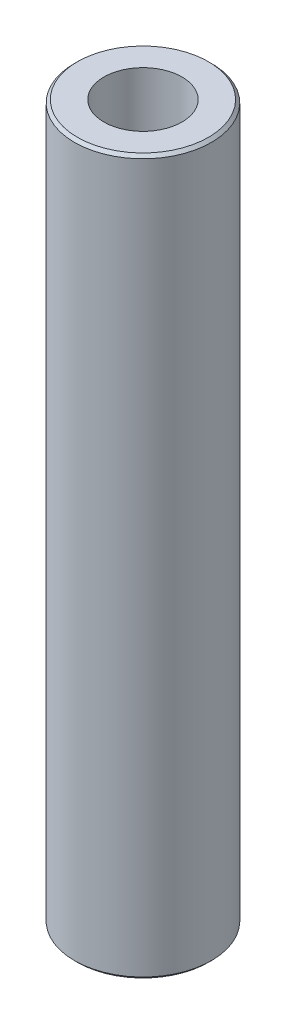
ISO-10303-21;
HEADER;
FILE_DESCRIPTION(('STEP AP214'),'2;1');
FILE_NAME('part.step','',(''),(''),'','','');
FILE_SCHEMA(('AUTOMOTIVE_DESIGN { 1 0 10303 214 1 1 1 1 }'));
ENDSEC;
DATA;
#1=APPLICATION_CONTEXT('core data for automotive mechanical design processes');
#2=APPLICATION_PROTOCOL_DEFINITION('international standard','automotive_design',2000,#1);
#3=PRODUCT_CONTEXT('',#1,'mechanical');
#4=PRODUCT('Part','Part','',(#3));
#5=PRODUCT_RELATED_PRODUCT_CATEGORY('part','',(#4));
#6=PRODUCT_DEFINITION_FORMATION('','',#4);
#7=PRODUCT_DEFINITION_CONTEXT('part definition',#1,'design');
#8=PRODUCT_DEFINITION('design','',#6,#7);
#9=PRODUCT_DEFINITION_SHAPE('','',#8);
#10=(LENGTH_UNIT() NAMED_UNIT(*) SI_UNIT(.MILLI.,.METRE.));
#11=(NAMED_UNIT(*) PLANE_ANGLE_UNIT() SI_UNIT($,.RADIAN.));
#12=(NAMED_UNIT(*) SI_UNIT($,.STERADIAN.) SOLID_ANGLE_UNIT());
#13=UNCERTAINTY_MEASURE_WITH_UNIT(LENGTH_MEASURE(1.E-05),#10,'distance_accuracy_value','');
#14=(GEOMETRIC_REPRESENTATION_CONTEXT(3) GLOBAL_UNCERTAINTY_ASSIGNED_CONTEXT((#13)) GLOBAL_UNIT_ASSIGNED_CONTEXT((#10,
#11,#12)) REPRESENTATION_CONTEXT('',''));
#15=CARTESIAN_POINT('',(0.,0.,0.));
#16=DIRECTION('',(0.,0.,1.));
#17=DIRECTION('',(1.,0.,0.));
#18=AXIS2_PLACEMENT_3D('',#15,#16,#17);
#19=CARTESIAN_POINT('',(0.,600.,0.));
#20=DIRECTION('',(0.,-1.,0.));
#21=DIRECTION('',(0.,0.,-1.));
#22=AXIS2_PLACEMENT_3D('',#19,#20,#21);
#23=CYLINDRICAL_SURFACE('',#22,57.5);
#24=CARTESIAN_POINT('',(0.,597.525181675945,0.));
#25=DIRECTION('',(0.,1.,0.));
#26=DIRECTION('',(0.,0.,1.));
#27=AXIS2_PLACEMENT_3D('',#24,#25,#26);
#28=CIRCLE('',#27,57.5);
#29=CARTESIAN_POINT('',(0.,597.525181675945,57.5));
#30=VERTEX_POINT('',#29);
#31=EDGE_CURVE('E50',#30,#30,#28,.F.);
#32=ORIENTED_EDGE('',*,*,#31,.T.);
#33=EDGE_LOOP('',(#32));
#34=FACE_BOUND('',#33,.T.);
#35=CARTESIAN_POINT('',(0.,2.47481832405538,0.));
#36=DIRECTION('',(0.,1.,0.));
#37=DIRECTION('',(0.,0.,1.));
#38=AXIS2_PLACEMENT_3D('',#35,#36,#37);
#39=CIRCLE('',#38,57.5);
#40=CARTESIAN_POINT('',(0.,2.47481832405538,57.5));
#41=VERTEX_POINT('',#40);
#42=EDGE_CURVE('E51',#41,#41,#39,.T.);
#43=ORIENTED_EDGE('',*,*,#42,.T.);
#44=EDGE_LOOP('',(#43));
#45=FACE_BOUND('',#44,.T.);
#46=ADVANCED_FACE('F39',(#34,#45),#23,.T.);
#47=CARTESIAN_POINT('',(0.,600.,0.));
#48=DIRECTION('',(0.,1.,0.));
#49=DIRECTION('',(0.,0.,1.));
#50=AXIS2_PLACEMENT_3D('',#47,#48,#49);
#51=PLANE('',#50);
#52=CARTESIAN_POINT('',(0.,600.,0.));
#53=DIRECTION('',(0.,1.,0.));
#54=DIRECTION('',(0.,0.,1.));
#55=AXIS2_PLACEMENT_3D('',#52,#53,#54);
#56=CIRCLE('',#55,55.0251816759446);
#57=CARTESIAN_POINT('',(0.,600.,55.0251816759446));
#58=VERTEX_POINT('',#57);
#59=EDGE_CURVE('E54',#58,#58,#56,.T.);
#60=ORIENTED_EDGE('',*,*,#59,.T.);
#61=EDGE_LOOP('',(#60));
#62=FACE_BOUND('',#61,.T.);
#63=CARTESIAN_POINT('',(0.,600.,0.));
#64=DIRECTION('',(0.,1.,0.));
#65=DIRECTION('',(0.,0.,1.));
#66=AXIS2_PLACEMENT_3D('',#63,#64,#65);
#67=CIRCLE('',#66,32.8024963492482);
#68=CARTESIAN_POINT('',(0.,600.,32.8024963492482));
#69=VERTEX_POINT('',#68);
#70=EDGE_CURVE('E58',#69,#69,#67,.T.);
#71=ORIENTED_EDGE('',*,*,#70,.F.);
#72=EDGE_LOOP('',(#71));
#73=FACE_BOUND('',#72,.T.);
#74=ADVANCED_FACE('F69',(#62,#73),#51,.T.);
#75=CARTESIAN_POINT('',(0.,0.,0.));
#76=DIRECTION('',(0.,1.,0.));
#77=DIRECTION('',(0.,0.,1.));
#78=AXIS2_PLACEMENT_3D('',#75,#76,#77);
#79=PLANE('',#78);
#80=CARTESIAN_POINT('',(0.,0.,0.));
#81=DIRECTION('',(0.,1.,0.));
#82=DIRECTION('',(0.,0.,1.));
#83=AXIS2_PLACEMENT_3D('',#80,#81,#82);
#84=CIRCLE('',#83,55.0251816759446);
#85=CARTESIAN_POINT('',(0.,0.,55.0251816759446));
#86=VERTEX_POINT('',#85);
#87=EDGE_CURVE('E10',#86,#86,#84,.F.);
#88=ORIENTED_EDGE('',*,*,#87,.T.);
#89=EDGE_LOOP('',(#88));
#90=FACE_BOUND('',#89,.T.);
#91=CARTESIAN_POINT('',(0.,0.,0.));
#92=DIRECTION('',(0.,1.,0.));
#93=DIRECTION('',(0.,0.,1.));
#94=AXIS2_PLACEMENT_3D('',#91,#92,#93);
#95=CIRCLE('',#94,32.8024963492482);
#96=CARTESIAN_POINT('',(0.,0.,32.8024963492482));
#97=VERTEX_POINT('',#96);
#98=EDGE_CURVE('E63',#97,#97,#95,.T.);
#99=ORIENTED_EDGE('',*,*,#98,.T.);
#100=EDGE_LOOP('',(#99));
#101=FACE_BOUND('',#100,.T.);
#102=ADVANCED_FACE('F75',(#90,#101),#79,.F.);
#103=CARTESIAN_POINT('',(0.,600.,0.));
#104=DIRECTION('',(0.,-1.,0.));
#105=DIRECTION('',(0.,0.,-1.));
#106=AXIS2_PLACEMENT_3D('',#103,#104,#105);
#107=CYLINDRICAL_SURFACE('',#106,32.8024963492482);
#108=ORIENTED_EDGE('',*,*,#70,.T.);
#109=EDGE_LOOP('',(#108));
#110=FACE_BOUND('',#109,.T.);
#111=ORIENTED_EDGE('',*,*,#98,.F.);
#112=EDGE_LOOP('',(#111));
#113=FACE_BOUND('',#112,.T.);
#114=ADVANCED_FACE('F70',(#110,#113),#107,.F.);
#115=CARTESIAN_POINT('',(0.,600.,0.));
#116=DIRECTION('',(0.,-1.,0.));
#117=DIRECTION('',(0.,0.,-1.));
#118=AXIS2_PLACEMENT_3D('',#115,#116,#117);
#119=CONICAL_SURFACE('',#118,55.0251816759446,0.785398163397427);
#120=ORIENTED_EDGE('',*,*,#31,.F.);
#121=EDGE_LOOP('',(#120));
#122=FACE_BOUND('',#121,.T.);
#123=ORIENTED_EDGE('',*,*,#59,.F.);
#124=EDGE_LOOP('',(#123));
#125=FACE_BOUND('',#124,.T.);
#126=ADVANCED_FACE('F81',(#122,#125),#119,.T.);
#127=CARTESIAN_POINT('',(0.,2.47481832405538,0.));
#128=DIRECTION('',(0.,1.,0.));
#129=DIRECTION('',(0.,0.,1.));
#130=AXIS2_PLACEMENT_3D('',#127,#128,#129);
#131=CONICAL_SURFACE('',#130,57.5,0.785398163397459);
#132=ORIENTED_EDGE('',*,*,#87,.F.);
#133=EDGE_LOOP('',(#132));
#134=FACE_BOUND('',#133,.T.);
#135=ORIENTED_EDGE('',*,*,#42,.F.);
#136=EDGE_LOOP('',(#135));
#137=FACE_BOUND('',#136,.T.);
#138=ADVANCED_FACE('F45',(#134,#137),#131,.T.);
#139=CLOSED_SHELL('',(#46,#74,#102,#114,#126,#138));
#140=MANIFOLD_SOLID_BREP('B2',#139);
#141=ADVANCED_BREP_SHAPE_REPRESENTATION('',(#18,#140),#14);
#142=SHAPE_DEFINITION_REPRESENTATION(#9,#141);
ENDSEC;
END-ISO-10303-21;
